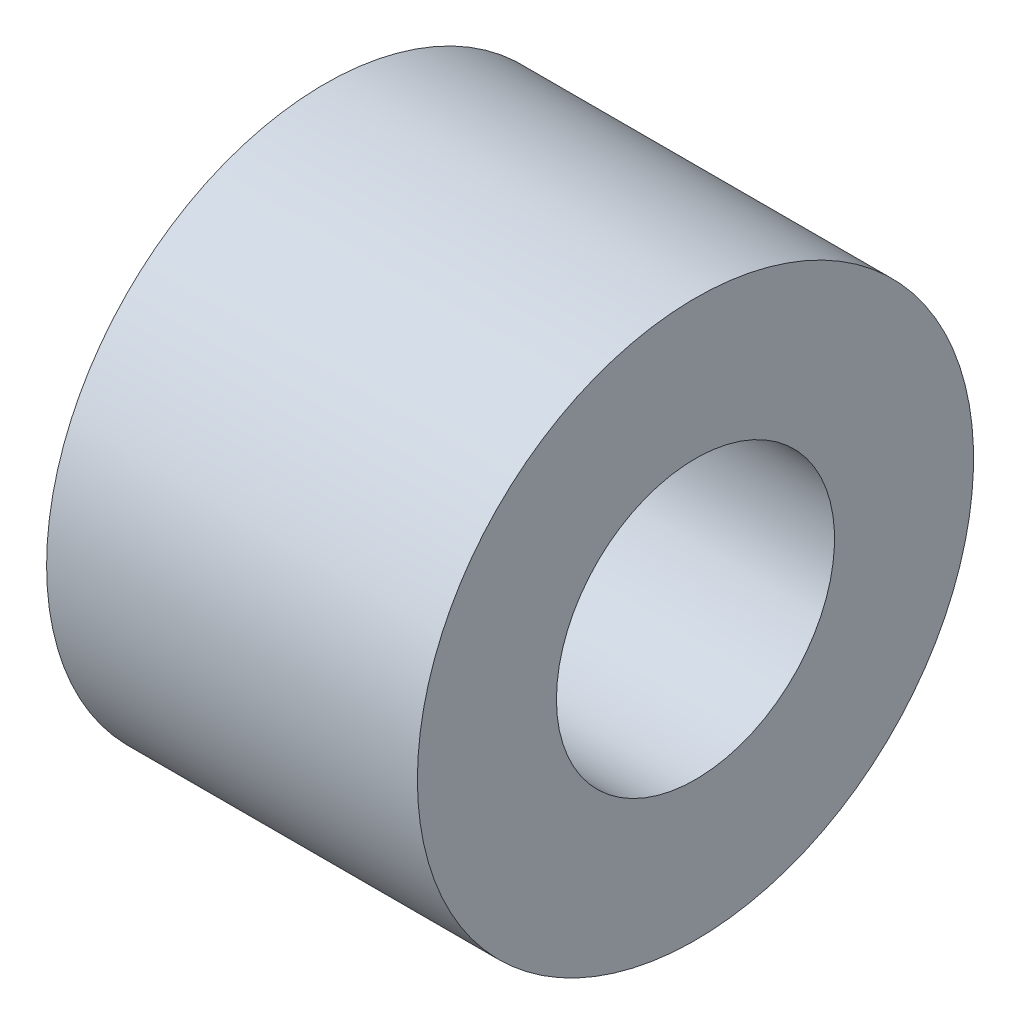
ISO-10303-21;
HEADER;
FILE_DESCRIPTION(('STEP AP214'),'2;1');
FILE_NAME('part.step','',(''),(''),'','','');
FILE_SCHEMA(('AUTOMOTIVE_DESIGN { 1 0 10303 214 1 1 1 1 }'));
ENDSEC;
DATA;
#1=APPLICATION_CONTEXT('core data for automotive mechanical design processes');
#2=APPLICATION_PROTOCOL_DEFINITION('international standard','automotive_design',2000,#1);
#3=PRODUCT_CONTEXT('',#1,'mechanical');
#4=PRODUCT('Part','Part','',(#3));
#5=PRODUCT_RELATED_PRODUCT_CATEGORY('part','',(#4));
#6=PRODUCT_DEFINITION_FORMATION('','',#4);
#7=PRODUCT_DEFINITION_CONTEXT('part definition',#1,'design');
#8=PRODUCT_DEFINITION('design','',#6,#7);
#9=PRODUCT_DEFINITION_SHAPE('','',#8);
#10=(LENGTH_UNIT() NAMED_UNIT(*) SI_UNIT(.MILLI.,.METRE.));
#11=(NAMED_UNIT(*) PLANE_ANGLE_UNIT() SI_UNIT($,.RADIAN.));
#12=(NAMED_UNIT(*) SI_UNIT($,.STERADIAN.) SOLID_ANGLE_UNIT());
#13=UNCERTAINTY_MEASURE_WITH_UNIT(LENGTH_MEASURE(1.E-05),#10,'distance_accuracy_value','');
#14=(GEOMETRIC_REPRESENTATION_CONTEXT(3) GLOBAL_UNCERTAINTY_ASSIGNED_CONTEXT((#13)) GLOBAL_UNIT_ASSIGNED_CONTEXT((#10,
#11,#12)) REPRESENTATION_CONTEXT('',''));
#15=CARTESIAN_POINT('',(0.,0.,0.));
#16=DIRECTION('',(0.,0.,1.));
#17=DIRECTION('',(1.,0.,0.));
#18=AXIS2_PLACEMENT_3D('',#15,#16,#17);
#19=CARTESIAN_POINT('',(-23.907423,3.75,0.));
#20=DIRECTION('',(1.,0.,0.));
#21=DIRECTION('',(0.,0.,-1.));
#22=AXIS2_PLACEMENT_3D('',#19,#20,#21);
#23=PLANE('',#22);
#24=CARTESIAN_POINT('',(-23.907423,0.,0.));
#25=DIRECTION('',(-1.,0.,0.));
#26=DIRECTION('',(0.,0.,1.));
#27=AXIS2_PLACEMENT_3D('',#24,#25,#26);
#28=CIRCLE('',#27,3.75);
#29=CARTESIAN_POINT('',(-23.907423,0.,3.75));
#30=VERTEX_POINT('',#29);
#31=EDGE_CURVE('E45',#30,#30,#28,.T.);
#32=ORIENTED_EDGE('',*,*,#31,.F.);
#33=EDGE_LOOP('',(#32));
#34=FACE_BOUND('',#33,.T.);
#35=CARTESIAN_POINT('',(-23.907423,0.,0.));
#36=DIRECTION('',(-1.,0.,0.));
#37=DIRECTION('',(0.,0.,1.));
#38=AXIS2_PLACEMENT_3D('',#35,#36,#37);
#39=CIRCLE('',#38,7.5);
#40=CARTESIAN_POINT('',(-23.907423,0.,7.5));
#41=VERTEX_POINT('',#40);
#42=EDGE_CURVE('E10',#41,#41,#39,.T.);
#43=ORIENTED_EDGE('',*,*,#42,.T.);
#44=EDGE_LOOP('',(#43));
#45=FACE_BOUND('',#44,.T.);
#46=ADVANCED_FACE('F31',(#34,#45),#23,.F.);
#47=CARTESIAN_POINT('',(-47.5268041237113,0.,0.));
#48=DIRECTION('',(-1.,0.,0.));
#49=DIRECTION('',(0.,0.,1.));
#50=AXIS2_PLACEMENT_3D('',#47,#48,#49);
#51=CYLINDRICAL_SURFACE('',#50,7.5);
#52=ORIENTED_EDGE('',*,*,#42,.F.);
#53=EDGE_LOOP('',(#52));
#54=FACE_BOUND('',#53,.T.);
#55=CARTESIAN_POINT('',(-13.907423,0.,0.));
#56=DIRECTION('',(-1.,0.,0.));
#57=DIRECTION('',(0.,0.,1.));
#58=AXIS2_PLACEMENT_3D('',#55,#56,#57);
#59=CIRCLE('',#58,7.5);
#60=CARTESIAN_POINT('',(-13.907423,0.,7.5));
#61=VERTEX_POINT('',#60);
#62=EDGE_CURVE('E37',#61,#61,#59,.T.);
#63=ORIENTED_EDGE('',*,*,#62,.T.);
#64=EDGE_LOOP('',(#63));
#65=FACE_BOUND('',#64,.T.);
#66=ADVANCED_FACE('F54',(#54,#65),#51,.T.);
#67=CARTESIAN_POINT('',(-13.907423,7.5,0.));
#68=DIRECTION('',(-1.,0.,0.));
#69=DIRECTION('',(0.,0.,1.));
#70=AXIS2_PLACEMENT_3D('',#67,#68,#69);
#71=PLANE('',#70);
#72=ORIENTED_EDGE('',*,*,#62,.F.);
#73=EDGE_LOOP('',(#72));
#74=FACE_BOUND('',#73,.T.);
#75=CARTESIAN_POINT('',(-13.907423,0.,0.));
#76=DIRECTION('',(-1.,0.,0.));
#77=DIRECTION('',(0.,0.,1.));
#78=AXIS2_PLACEMENT_3D('',#75,#76,#77);
#79=CIRCLE('',#78,3.75);
#80=CARTESIAN_POINT('',(-13.907423,0.,3.75));
#81=VERTEX_POINT('',#80);
#82=EDGE_CURVE('E41',#81,#81,#79,.T.);
#83=ORIENTED_EDGE('',*,*,#82,.T.);
#84=EDGE_LOOP('',(#83));
#85=FACE_BOUND('',#84,.T.);
#86=ADVANCED_FACE('F58',(#74,#85),#71,.F.);
#87=CARTESIAN_POINT('',(-47.5268041237113,0.,0.));
#88=DIRECTION('',(-1.,0.,0.));
#89=DIRECTION('',(0.,0.,1.));
#90=AXIS2_PLACEMENT_3D('',#87,#88,#89);
#91=CYLINDRICAL_SURFACE('',#90,3.75);
#92=ORIENTED_EDGE('',*,*,#82,.F.);
#93=EDGE_LOOP('',(#92));
#94=FACE_BOUND('',#93,.T.);
#95=ORIENTED_EDGE('',*,*,#31,.T.);
#96=EDGE_LOOP('',(#95));
#97=FACE_BOUND('',#96,.T.);
#98=ADVANCED_FACE('F51',(#94,#97),#91,.F.);
#99=CLOSED_SHELL('',(#46,#66,#86,#98));
#100=MANIFOLD_SOLID_BREP('B2',#99);
#101=ADVANCED_BREP_SHAPE_REPRESENTATION('',(#18,#100),#14);
#102=SHAPE_DEFINITION_REPRESENTATION(#9,#101);
ENDSEC;
END-ISO-10303-21;
